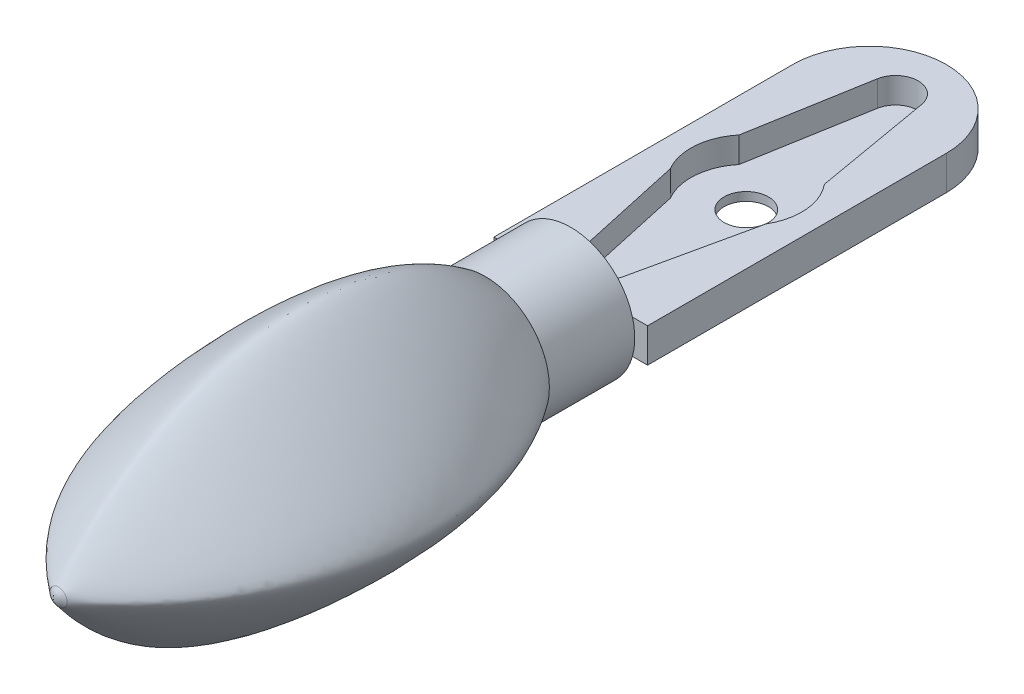
ISO-10303-21;
HEADER;
FILE_DESCRIPTION(('STEP AP214'),'2;1');
FILE_NAME('part.step','',(''),(''),'','','');
FILE_SCHEMA(('AUTOMOTIVE_DESIGN { 1 0 10303 214 1 1 1 1 }'));
ENDSEC;
DATA;
#1=APPLICATION_CONTEXT('core data for automotive mechanical design processes');
#2=APPLICATION_PROTOCOL_DEFINITION('international standard','automotive_design',2000,#1);
#3=PRODUCT_CONTEXT('',#1,'mechanical');
#4=PRODUCT('Part','Part','',(#3));
#5=PRODUCT_RELATED_PRODUCT_CATEGORY('part','',(#4));
#6=PRODUCT_DEFINITION_FORMATION('','',#4);
#7=PRODUCT_DEFINITION_CONTEXT('part definition',#1,'design');
#8=PRODUCT_DEFINITION('design','',#6,#7);
#9=PRODUCT_DEFINITION_SHAPE('','',#8);
#10=(LENGTH_UNIT() NAMED_UNIT(*) SI_UNIT(.MILLI.,.METRE.));
#11=(NAMED_UNIT(*) PLANE_ANGLE_UNIT() SI_UNIT($,.RADIAN.));
#12=(NAMED_UNIT(*) SI_UNIT($,.STERADIAN.) SOLID_ANGLE_UNIT());
#13=UNCERTAINTY_MEASURE_WITH_UNIT(LENGTH_MEASURE(1.E-05),#10,'distance_accuracy_value','');
#14=(GEOMETRIC_REPRESENTATION_CONTEXT(3) GLOBAL_UNCERTAINTY_ASSIGNED_CONTEXT((#13)) GLOBAL_UNIT_ASSIGNED_CONTEXT((#10,
#11,#12)) REPRESENTATION_CONTEXT('',''));
#15=CARTESIAN_POINT('',(0.,0.,0.));
#16=DIRECTION('',(0.,0.,1.));
#17=DIRECTION('',(1.,0.,0.));
#18=AXIS2_PLACEMENT_3D('',#15,#16,#17);
#19=CARTESIAN_POINT('',(10.0199999018431,-3.02000028851811,59.6713058607412));
#20=CARTESIAN_POINT('',(10.0200000172503,-2.61200028851814,59.9359846592579));
#21=CARTESIAN_POINT('',(10.0200001326576,-2.20400028851817,60.045061782606));
#22=CARTESIAN_POINT('',(10.0200002480648,-1.79600028851819,60.045285434479));
#23=CARTESIAN_POINT('',(10.0200003634721,-1.38800028851822,59.9358519810749));
#24=CARTESIAN_POINT('',(10.0200004788793,-0.980000288518246,59.6719841276044));
#25=CARTESIAN_POINT('',(9.81599986377084,-3.02000023081447,59.7611798395393));
#26=CARTESIAN_POINT('',(9.81599997917809,-2.6120002308145,60.0530891284426));
#27=CARTESIAN_POINT('',(9.81600009458533,-2.20400023081453,60.1740586836226));
#28=CARTESIAN_POINT('',(9.81600020999258,-1.79600023081456,60.1746436779478));
#29=CARTESIAN_POINT('',(9.81600032539983,-1.38800023081459,60.0526005432592));
#30=CARTESIAN_POINT('',(9.81600044080708,-0.980000230814612,59.7615503660819));
#31=CARTESIAN_POINT('',(9.6119998256986,-3.02000017311084,59.8452729788772));
#32=CARTESIAN_POINT('',(9.61199994110584,-2.61200017311087,60.1662060321596));
#33=CARTESIAN_POINT('',(9.61200005651309,-2.2040001731109,60.2976076752485));
#34=CARTESIAN_POINT('',(9.61200017192034,-1.79600017311093,60.2987751637316));
#35=CARTESIAN_POINT('',(9.61200028732759,-1.38800017311095,60.1652899757582));
#36=CARTESIAN_POINT('',(9.61200040273484,-0.980000173110978,59.8454013997782));
#37=CARTESIAN_POINT('',(9.40799978762636,-3.0200001154072,59.9296887772695));
#38=CARTESIAN_POINT('',(9.40799990303361,-2.61200011540723,60.2950514761496));
#39=CARTESIAN_POINT('',(9.40800001844085,-2.20400011540726,60.4217271542177));
#40=CARTESIAN_POINT('',(9.4080001338481,-1.79600011540729,60.4215732040455));
#41=CARTESIAN_POINT('',(9.40800024925534,-1.38800011540732,60.2943340917807));
#42=CARTESIAN_POINT('',(9.4080003646626,-0.980000115407343,59.9303294263708));
#43=CARTESIAN_POINT('',(9.16319973224945,-3.02000004616284,59.9906751110089));
#44=CARTESIAN_POINT('',(9.16319984765669,-2.61200004616287,60.4066717478284));
#45=CARTESIAN_POINT('',(9.16319996306394,-2.2040000461629,60.4769060065083));
#46=CARTESIAN_POINT('',(9.16320007847118,-1.79600004616293,60.4823320662432));
#47=CARTESIAN_POINT('',(9.16320019387844,-1.38800004616296,60.4039379670143));
#48=CARTESIAN_POINT('',(9.16320030928569,-0.98000004616298,59.9913886654708));
#49=CARTESIAN_POINT('',(8.91839967687254,-3.01999997691847,59.9786981725399));
#50=CARTESIAN_POINT('',(8.91839979227978,-2.61199997691851,60.3861826542139));
#51=CARTESIAN_POINT('',(8.91839990768704,-2.20399997691853,60.4648540857779));
#52=CARTESIAN_POINT('',(8.91840002309428,-1.79599997691856,60.469162877881));
#53=CARTESIAN_POINT('',(8.91840013850153,-1.38799997691859,60.3839262392396));
#54=CARTESIAN_POINT('',(8.91840025390878,-0.979999976918615,59.9793096431932));
#55=CARTESIAN_POINT('',(8.87759965956787,-3.01999996537775,59.9747084966445));
#56=CARTESIAN_POINT('',(8.87759977497512,-2.61199996537778,60.3791442810936));
#57=CARTESIAN_POINT('',(8.87759989038237,-2.2039999653778,60.4608992058125));
#58=CARTESIAN_POINT('',(8.87760000578961,-1.79599996537783,60.4649246894336));
#59=CARTESIAN_POINT('',(8.87760012119686,-1.38799996537786,60.376982972844));
#60=CARTESIAN_POINT('',(8.87760023660411,-0.979999965377885,59.9753186031182));
#61=CARTESIAN_POINT('',(8.67359962155773,-3.01999990767411,59.9460763977806));
#62=CARTESIAN_POINT('',(8.67359973696498,-2.61199990767414,60.3289409771327));
#63=CARTESIAN_POINT('',(8.67359985237222,-2.20399990767417,60.4302764471199));
#64=CARTESIAN_POINT('',(8.67359996777947,-1.7959999076742,60.4326465825806));
#65=CARTESIAN_POINT('',(8.67360008318672,-1.38799990767423,60.3273728719974));
#66=CARTESIAN_POINT('',(8.67360019859397,-0.97999990767425,59.946609425415));
#67=CARTESIAN_POINT('',(8.46959958354759,-3.01999984997047,59.8788246496406));
#68=CARTESIAN_POINT('',(8.46959969895483,-2.61199984997051,60.2166602439782));
#69=CARTESIAN_POINT('',(8.46959981436209,-2.20399984997054,60.3454706333419));
#70=CARTESIAN_POINT('',(8.46959992976933,-1.79599984997056,60.346190582432));
#71=CARTESIAN_POINT('',(8.46960004517658,-1.38799984997059,60.2158152865172));
#72=CARTESIAN_POINT('',(8.46960016058383,-0.979999849970615,59.8790348028657));
#73=CARTESIAN_POINT('',(8.30639956284212,-3.01999980380757,59.8139327161403));
#74=CARTESIAN_POINT('',(8.30639967824936,-2.6119998038076,60.1215715258685));
#75=CARTESIAN_POINT('',(8.30639979365661,-2.20399980380763,60.2474553097653));
#76=CARTESIAN_POINT('',(8.30639990906386,-1.79599980380766,60.2482160852123));
#77=CARTESIAN_POINT('',(8.30640002447111,-1.38799980380768,60.1209693720613));
#78=CARTESIAN_POINT('',(8.30640013987836,-0.979999803807709,59.814286482078));
#79=CARTESIAN_POINT('',(8.14319954213664,-3.01999975764466,59.7444310830504));
#80=CARTESIAN_POINT('',(8.14319965754389,-2.61199975764469,60.0289009097591));
#81=CARTESIAN_POINT('',(8.14319977295114,-2.20399975764472,60.1489646147589));
#82=CARTESIAN_POINT('',(8.14319988835838,-1.79599975764475,60.1492234588359));
#83=CARTESIAN_POINT('',(8.14320000376564,-1.38799975764478,60.0285716534876));
#84=CARTESIAN_POINT('',(8.14320011917289,-0.979999757644803,59.7450099194435));
#85=CARTESIAN_POINT('',(7.97999952143117,-3.01999971148176,59.6710188183758));
#86=CARTESIAN_POINT('',(7.97999963683842,-2.61199971148179,59.9342651427469));
#87=CARTESIAN_POINT('',(7.97999975224567,-2.20399971148182,60.0461448055459));
#88=CARTESIAN_POINT('',(7.97999986765291,-1.79599971148184,60.0460081890795));
#89=CARTESIAN_POINT('',(7.97999998306017,-1.38799971148187,59.9341338749382));
#90=CARTESIAN_POINT('',(7.98000009846741,-0.979999711481898,59.6718461034298));
#91=B_SPLINE_SURFACE_WITH_KNOTS('',5,5,((#19,#20,#21,#22,#23,#24),(#25,#26,#27,#28,#29,#30),
(#31,#32,#33,#34,#35,#36),(#37,#38,#39,#40,#41,#42),(#43,#44,#45,#46,#47,#48),(#49,#50,#51,#52,
#53,#54),(#55,#56,#57,#58,#59,#60),(#61,#62,#63,#64,#65,#66),(#67,#68,#69,#70,#71,#72),(#73,#74,
#75,#76,#77,#78),(#79,#80,#81,#82,#83,#84),(#85,#86,#87,#88,#89,#90)),.UNSPECIFIED.,.F.,.F.,.F.,
(6,3,3,6),(6,6),(-1.02000024710375,-5.67425053610293E-08,0.204000029780841,1.02000013330824),
(-1.02000000041239,1.01999999958755),.UNSPECIFIED.);
#92=CARTESIAN_POINT('',(9.,-3.00000000000001,60.));
#93=CARTESIAN_POINT('',(8.86910030695214,-3.00000000000001,60.));
#94=CARTESIAN_POINT('',(8.60734891089191,-2.947991074474,60.));
#95=CARTESIAN_POINT('',(8.27446701565593,-2.72553298434406,59.9999999999999));
#96=CARTESIAN_POINT('',(8.05200892552601,-2.39265108910809,60.0000000000001));
#97=CARTESIAN_POINT('',(7.99999999999999,-2.13089969304786,60.));
#98=CARTESIAN_POINT('',(7.99999999999999,-1.86910030695214,60.));
#99=CARTESIAN_POINT('',(8.05200892552601,-1.60734891089191,60.0000000000001));
#100=CARTESIAN_POINT('',(8.27446701565593,-1.27446701565593,59.9999999999998));
#101=CARTESIAN_POINT('',(8.60734891089192,-1.052008925526,60.0000000000001));
#102=CARTESIAN_POINT('',(8.86910030695214,-0.999999999999993,60.));
#103=CARTESIAN_POINT('',(9.13089969304786,-0.999999999999993,60.));
#104=CARTESIAN_POINT('',(9.39265108910809,-1.052008925526,60.));
#105=CARTESIAN_POINT('',(9.72553298434406,-1.27446701565593,60.));
#106=CARTESIAN_POINT('',(9.947991074474,-1.60734891089191,60.0000000000001));
#107=CARTESIAN_POINT('',(10.,-1.86910030695214,60.));
#108=CARTESIAN_POINT('',(10.,-2.13089969304786,60.));
#109=CARTESIAN_POINT('',(9.94799107447399,-2.39265108910809,60.));
#110=CARTESIAN_POINT('',(9.72553298434407,-2.72553298434407,60.));
#111=CARTESIAN_POINT('',(9.39265108910808,-2.947991074474,60.));
#112=CARTESIAN_POINT('',(9.13089969304786,-3.00000000000001,60.));
#113=CARTESIAN_POINT('',(9.,-3.00000000000001,60.));
#114=B_SPLINE_CURVE_WITH_KNOTS('',3,(#92,#93,#94,#95,#96,#97,#98,#99,#100,#101,#102,#103,#104,
#105,#106,#107,#108,#109,#110,#111,#112,#113),.UNSPECIFIED.,.T.,.F.,(4,1,1,1,2,1,1,1,2,1,1,1,2,
1,1,1,4),(0.,0.0625,0.125,0.1875,0.25,0.3125,0.375,0.4375,0.5,0.5625,0.625,0.6875,0.75,0.8125,
0.875,0.9375,1.),.UNSPECIFIED.);
#115=CARTESIAN_POINT('',(9.,-3.00000000000001,60.));
#116=VERTEX_POINT('',#115);
#117=EDGE_CURVE('E138',#116,#116,#114,.T.);
#118=ORIENTED_EDGE('',*,*,#117,.F.);
#119=EDGE_LOOP('',(#118));
#120=FACE_BOUND('',#119,.T.);
#121=ADVANCED_FACE('F125',(#120),#91,.F.);
#122=CARTESIAN_POINT('',(9.,5.5,10.));
#123=DIRECTION('',(0.,0.,-1.));
#124=DIRECTION('',(0.,1.,0.));
#125=AXIS2_PLACEMENT_3D('',#122,#123,#124);
#126=PLANE('',#125);
#127=CARTESIAN_POINT('',(9.,-9.5,10.));
#128=CARTESIAN_POINT('',(9.98174769785895,-9.5,10.));
#129=CARTESIAN_POINT('',(11.9449156493394,-9.10992505068653,10.));
#130=CARTESIAN_POINT('',(14.4414893574974,-7.44148935749734,9.99999999999998));
#131=CARTESIAN_POINT('',(16.1099250506865,-4.94491564933942,10.));
#132=CARTESIAN_POINT('',(16.5,-2.98174769785896,10.));
#133=CARTESIAN_POINT('',(16.5,-1.01825230214104,10.));
#134=CARTESIAN_POINT('',(16.1099250506865,0.944915649339421,10.));
#135=CARTESIAN_POINT('',(14.4414893574973,3.44148935749733,9.99999999999998));
#136=CARTESIAN_POINT('',(11.9449156493394,5.10992505068653,10.));
#137=CARTESIAN_POINT('',(9.98174769785895,5.5,10.));
#138=CARTESIAN_POINT('',(8.01825230214104,5.5,10.));
#139=CARTESIAN_POINT('',(6.05508435066059,5.10992505068652,10.));
#140=CARTESIAN_POINT('',(3.55851064250266,3.44148935749734,9.99999999999998));
#141=CARTESIAN_POINT('',(1.89007494931348,0.94491564933942,10.));
#142=CARTESIAN_POINT('',(1.5,-1.01825230214104,10.));
#143=CARTESIAN_POINT('',(1.5,-2.98174769785896,10.));
#144=CARTESIAN_POINT('',(1.89007494931348,-4.94491564933941,10.));
#145=CARTESIAN_POINT('',(3.55851064250266,-7.44148935749735,9.99999999999999));
#146=CARTESIAN_POINT('',(6.05508435066059,-9.10992505068652,10.));
#147=CARTESIAN_POINT('',(8.01825230214104,-9.5,10.));
#148=CARTESIAN_POINT('',(9.,-9.5,10.));
#149=B_SPLINE_CURVE_WITH_KNOTS('',3,(#127,#128,#129,#130,#131,#132,#133,#134,#135,#136,#137,
#138,#139,#140,#141,#142,#143,#144,#145,#146,#147,#148),.UNSPECIFIED.,.T.,.F.,(4,1,1,1,2,1,1,1,
2,1,1,1,2,1,1,1,4),(0.,0.0625,0.125,0.1875,0.25,0.3125,0.375,0.4375,0.5,0.5625,0.625,0.6875,
0.75,0.8125,0.875,0.9375,1.),.UNSPECIFIED.);
#150=CARTESIAN_POINT('',(9.,-9.5,10.));
#151=VERTEX_POINT('',#150);
#152=EDGE_CURVE('E13',#151,#151,#149,.T.);
#153=ORIENTED_EDGE('',*,*,#152,.F.);
#154=EDGE_LOOP('',(#153));
#155=FACE_BOUND('',#154,.T.);
#156=ADVANCED_FACE('F167',(#155),#126,.T.);
#157=CARTESIAN_POINT('',(9.,-9.5,10.));
#158=CARTESIAN_POINT('',(9.,-13.3872736073307,14.9789819894649));
#159=CARTESIAN_POINT('',(9.,-17.0648639396607,23.7681084370191));
#160=CARTESIAN_POINT('',(9.,-17.1229033941333,36.4134774412373));
#161=CARTESIAN_POINT('',(9.,-13.8336374596375,48.6236967448897));
#162=CARTESIAN_POINT('',(9.,-8.03108860323303,56.1804050979084));
#163=CARTESIAN_POINT('',(9.,-3.00000000000001,60.));
#164=CARTESIAN_POINT('',(9.98174769785895,-9.5,10.));
#165=CARTESIAN_POINT('',(9.88720903065772,-13.3872736073307,14.9789819894649));
#166=CARTESIAN_POINT('',(9.74540102985588,-17.0648639396607,23.7681084370191));
#167=CARTESIAN_POINT('',(9.55632369545341,-17.1229033941333,36.4134774412373));
#168=CARTESIAN_POINT('',(9.36724636105095,-13.8336374596375,48.6236967448897));
#169=CARTESIAN_POINT('',(9.22543836024909,-8.03108860323303,56.1804050979084));
#170=CARTESIAN_POINT('',(9.13089969304786,-3.00000000000001,60.));
#171=CARTESIAN_POINT('',(11.9449156493394,-9.10992505068653,10.));
#172=CARTESIAN_POINT('',(12.2375176768967,-12.458574570855,14.9789819894649));
#173=CARTESIAN_POINT('',(12.4072557083994,-15.597393782275,23.7681084370192));
#174=CARTESIAN_POINT('',(12.0278962934904,-15.5427485324469,36.4134774412373));
#175=CARTESIAN_POINT('',(11.2301237049604,-12.5592110672714,48.6236967448897));
#176=CARTESIAN_POINT('',(10.2148443378712,-7.40290848854873,56.1804050979084));
#177=CARTESIAN_POINT('',(9.39265108910808,-2.947991074474,60.));
#178=CARTESIAN_POINT('',(14.4414893574974,-7.44148935749734,9.99999999999998));
#179=CARTESIAN_POINT('',(16.2222421197012,-9.2222421197012,14.9789819894649));
#180=CARTESIAN_POINT('',(17.816711223674,-10.816711223674,23.7681084370191));
#181=CARTESIAN_POINT('',(17.5199628679874,-10.5199628679874,36.4134774412373));
#182=CARTESIAN_POINT('',(15.5495618178165,-8.54956181781652,48.6236967448896));
#183=CARTESIAN_POINT('',(12.4039613274221,-5.40396132742205,56.1804050979083));
#184=CARTESIAN_POINT('',(9.72553298434407,-2.72553298434407,60.));
#185=CARTESIAN_POINT('',(16.1099250506865,-4.94491564933942,10.));
#186=CARTESIAN_POINT('',(19.458574570855,-5.23751767689672,14.9789819894649));
#187=CARTESIAN_POINT('',(22.597393782275,-5.40725570839941,23.7681084370192));
#188=CARTESIAN_POINT('',(22.5427485324469,-5.02789629349042,36.4134774412373));
#189=CARTESIAN_POINT('',(19.5592110672714,-4.23012370496037,48.6236967448897));
#190=CARTESIAN_POINT('',(14.4029084885487,-3.21484433787125,56.1804050979084));
#191=CARTESIAN_POINT('',(9.94799107447399,-2.39265108910809,60.));
#192=CARTESIAN_POINT('',(16.5,-2.98174769785896,10.));
#193=CARTESIAN_POINT('',(20.3872736073306,-2.88720903065772,14.9789819894649));
#194=CARTESIAN_POINT('',(24.0648639396607,-2.74540102985587,23.7681084370191));
#195=CARTESIAN_POINT('',(24.1229033941333,-2.55632369545341,36.4134774412373));
#196=CARTESIAN_POINT('',(20.8336374596375,-2.36724636105094,48.6236967448897));
#197=CARTESIAN_POINT('',(15.031088603233,-2.22543836024909,56.1804050979084));
#198=CARTESIAN_POINT('',(10.,-2.13089969304786,60.));
#199=CARTESIAN_POINT('',(16.5,-1.01825230214104,10.));
#200=CARTESIAN_POINT('',(20.3872736073306,-1.11279096934228,14.9789819894649));
#201=CARTESIAN_POINT('',(24.0648639396607,-1.25459897014413,23.7681084370191));
#202=CARTESIAN_POINT('',(24.1229033941333,-1.44367630454659,36.4134774412373));
#203=CARTESIAN_POINT('',(20.8336374596375,-1.63275363894906,48.6236967448897));
#204=CARTESIAN_POINT('',(15.031088603233,-1.77456163975091,56.1804050979084));
#205=CARTESIAN_POINT('',(10.,-1.86910030695214,60.));
#206=CARTESIAN_POINT('',(16.1099250506865,0.944915649339421,10.));
#207=CARTESIAN_POINT('',(19.458574570855,1.23751767689672,14.9789819894649));
#208=CARTESIAN_POINT('',(22.597393782275,1.40725570839942,23.7681084370192));
#209=CARTESIAN_POINT('',(22.5427485324469,1.02789629349042,36.4134774412374));
#210=CARTESIAN_POINT('',(19.5592110672714,0.230123704960372,48.6236967448897));
#211=CARTESIAN_POINT('',(14.4029084885487,-0.785155662128749,56.1804050979084));
#212=CARTESIAN_POINT('',(9.947991074474,-1.60734891089191,60.0000000000001));
#213=CARTESIAN_POINT('',(14.4414893574973,3.44148935749733,9.99999999999998));
#214=CARTESIAN_POINT('',(16.2222421197012,5.2222421197012,14.9789819894649));
#215=CARTESIAN_POINT('',(17.816711223674,6.81671122367401,23.7681084370191));
#216=CARTESIAN_POINT('',(17.5199628679873,6.51996286798737,36.4134774412373));
#217=CARTESIAN_POINT('',(15.5495618178165,4.54956181781652,48.6236967448896));
#218=CARTESIAN_POINT('',(12.403961327422,1.40396132742205,56.1804050979083));
#219=CARTESIAN_POINT('',(9.72553298434406,-1.27446701565593,60.));
#220=CARTESIAN_POINT('',(11.9449156493394,5.10992505068653,10.));
#221=CARTESIAN_POINT('',(12.2375176768967,8.45857457085503,14.9789819894649));
#222=CARTESIAN_POINT('',(12.4072557083994,11.5973937822751,23.7681084370192));
#223=CARTESIAN_POINT('',(12.0278962934904,11.5427485324469,36.4134774412373));
#224=CARTESIAN_POINT('',(11.2301237049604,8.55921106727144,48.6236967448897));
#225=CARTESIAN_POINT('',(10.2148443378713,3.40290848854873,56.1804050979084));
#226=CARTESIAN_POINT('',(9.39265108910809,-1.052008925526,60.));
#227=CARTESIAN_POINT('',(9.98174769785895,5.5,10.));
#228=CARTESIAN_POINT('',(9.88720903065772,9.38727360733067,14.9789819894649));
#229=CARTESIAN_POINT('',(9.74540102985588,13.0648639396607,23.7681084370192));
#230=CARTESIAN_POINT('',(9.55632369545341,13.1229033941334,36.4134774412373));
#231=CARTESIAN_POINT('',(9.36724636105095,9.83363745963754,48.6236967448897));
#232=CARTESIAN_POINT('',(9.22543836024909,4.03108860323302,56.1804050979084));
#233=CARTESIAN_POINT('',(9.13089969304786,-0.999999999999993,60.));
#234=CARTESIAN_POINT('',(8.01825230214104,5.5,10.));
#235=CARTESIAN_POINT('',(8.11279096934227,9.38727360733067,14.9789819894649));
#236=CARTESIAN_POINT('',(8.25459897014413,13.0648639396607,23.7681084370192));
#237=CARTESIAN_POINT('',(8.44367630454659,13.1229033941334,36.4134774412373));
#238=CARTESIAN_POINT('',(8.63275363894906,9.83363745963754,48.6236967448897));
#239=CARTESIAN_POINT('',(8.7745616397509,4.03108860323302,56.1804050979084));
#240=CARTESIAN_POINT('',(8.86910030695214,-0.999999999999993,60.));
#241=CARTESIAN_POINT('',(6.05508435066059,5.10992505068652,10.));
#242=CARTESIAN_POINT('',(5.76248232310329,8.45857457085503,14.978981989465));
#243=CARTESIAN_POINT('',(5.5927442916006,11.5973937822751,23.7681084370192));
#244=CARTESIAN_POINT('',(5.97210370650959,11.5427485324469,36.4134774412374));
#245=CARTESIAN_POINT('',(6.76987629503964,8.55921106727143,48.6236967448898));
#246=CARTESIAN_POINT('',(7.78515566212876,3.40290848854873,56.1804050979085));
#247=CARTESIAN_POINT('',(8.60734891089192,-1.052008925526,60.0000000000001));
#248=CARTESIAN_POINT('',(3.55851064250266,3.44148935749734,9.99999999999998));
#249=CARTESIAN_POINT('',(1.7777578802988,5.2222421197012,14.9789819894649));
#250=CARTESIAN_POINT('',(0.183288776326013,6.81671122367401,23.7681084370191));
#251=CARTESIAN_POINT('',(0.480037132012637,6.51996286798738,36.4134774412372));
#252=CARTESIAN_POINT('',(2.45043818218349,4.54956181781652,48.6236967448895));
#253=CARTESIAN_POINT('',(5.59603867257794,1.40396132742205,56.1804050979082));
#254=CARTESIAN_POINT('',(8.27446701565593,-1.27446701565593,59.9999999999998));
#255=CARTESIAN_POINT('',(1.89007494931348,0.94491564933942,10.));
#256=CARTESIAN_POINT('',(-1.45857457085501,1.23751767689672,14.9789819894649));
#257=CARTESIAN_POINT('',(-4.59739378227501,1.40725570839942,23.7681084370192));
#258=CARTESIAN_POINT('',(-4.5427485324469,1.02789629349042,36.4134774412374));
#259=CARTESIAN_POINT('',(-1.5592110672714,0.23012370496037,48.6236967448897));
#260=CARTESIAN_POINT('',(3.59709151145128,-0.785155662128749,56.1804050979084));
#261=CARTESIAN_POINT('',(8.05200892552601,-1.60734891089191,60.0000000000001));
#262=CARTESIAN_POINT('',(1.5,-1.01825230214104,10.));
#263=CARTESIAN_POINT('',(-2.38727360733066,-1.11279096934228,14.9789819894649));
#264=CARTESIAN_POINT('',(-6.06486393966067,-1.25459897014413,23.7681084370191));
#265=CARTESIAN_POINT('',(-6.12290339413331,-1.44367630454659,36.4134774412373));
#266=CARTESIAN_POINT('',(-2.83363745963751,-1.63275363894906,48.6236967448897));
#267=CARTESIAN_POINT('',(2.96891139676698,-1.77456163975091,56.1804050979083));
#268=CARTESIAN_POINT('',(7.99999999999999,-1.86910030695214,60.));
#269=CARTESIAN_POINT('',(1.5,-2.98174769785896,10.));
#270=CARTESIAN_POINT('',(-2.38727360733066,-2.88720903065772,14.9789819894649));
#271=CARTESIAN_POINT('',(-6.06486393966067,-2.74540102985587,23.7681084370191));
#272=CARTESIAN_POINT('',(-6.12290339413331,-2.55632369545341,36.4134774412373));
#273=CARTESIAN_POINT('',(-2.83363745963751,-2.36724636105094,48.6236967448897));
#274=CARTESIAN_POINT('',(2.96891139676698,-2.22543836024909,56.1804050979083));
#275=CARTESIAN_POINT('',(7.99999999999999,-2.13089969304786,60.));
#276=CARTESIAN_POINT('',(1.89007494931348,-4.94491564933941,10.));
#277=CARTESIAN_POINT('',(-1.45857457085501,-5.23751767689671,14.9789819894649));
#278=CARTESIAN_POINT('',(-4.59739378227501,-5.40725570839941,23.7681084370192));
#279=CARTESIAN_POINT('',(-4.5427485324469,-5.02789629349042,36.4134774412374));
#280=CARTESIAN_POINT('',(-1.5592110672714,-4.23012370496037,48.6236967448897));
#281=CARTESIAN_POINT('',(3.59709151145129,-3.21484433787126,56.1804050979084));
#282=CARTESIAN_POINT('',(8.05200892552601,-2.39265108910809,60.0000000000001));
#283=CARTESIAN_POINT('',(3.55851064250266,-7.44148935749735,9.99999999999999));
#284=CARTESIAN_POINT('',(1.7777578802988,-9.2222421197012,14.9789819894649));
#285=CARTESIAN_POINT('',(0.183288776326013,-10.816711223674,23.7681084370191));
#286=CARTESIAN_POINT('',(0.480037132012639,-10.5199628679874,36.4134774412373));
#287=CARTESIAN_POINT('',(2.45043818218349,-8.54956181781652,48.6236967448896));
#288=CARTESIAN_POINT('',(5.59603867257795,-5.40396132742205,56.1804050979083));
#289=CARTESIAN_POINT('',(8.27446701565593,-2.72553298434406,59.9999999999999));
#290=CARTESIAN_POINT('',(6.05508435066059,-9.10992505068652,10.));
#291=CARTESIAN_POINT('',(5.76248232310329,-12.458574570855,14.9789819894649));
#292=CARTESIAN_POINT('',(5.5927442916006,-15.597393782275,23.7681084370192));
#293=CARTESIAN_POINT('',(5.97210370650959,-15.5427485324469,36.4134774412373));
#294=CARTESIAN_POINT('',(6.76987629503964,-12.5592110672714,48.6236967448897));
#295=CARTESIAN_POINT('',(7.78515566212875,-7.40290848854873,56.1804050979084));
#296=CARTESIAN_POINT('',(8.60734891089191,-2.947991074474,60.));
#297=CARTESIAN_POINT('',(8.01825230214104,-9.5,10.));
#298=CARTESIAN_POINT('',(8.11279096934227,-13.3872736073307,14.9789819894649));
#299=CARTESIAN_POINT('',(8.25459897014413,-17.0648639396607,23.7681084370191));
#300=CARTESIAN_POINT('',(8.44367630454659,-17.1229033941333,36.4134774412373));
#301=CARTESIAN_POINT('',(8.63275363894906,-13.8336374596375,48.6236967448897));
#302=CARTESIAN_POINT('',(8.7745616397509,-8.03108860323303,56.1804050979084));
#303=CARTESIAN_POINT('',(8.86910030695214,-3.00000000000001,60.));
#304=CARTESIAN_POINT('',(9.,-9.5,10.));
#305=CARTESIAN_POINT('',(9.,-13.3872736073307,14.9789819894649));
#306=CARTESIAN_POINT('',(9.,-17.0648639396607,23.7681084370191));
#307=CARTESIAN_POINT('',(9.,-17.1229033941333,36.4134774412373));
#308=CARTESIAN_POINT('',(9.,-13.8336374596375,48.6236967448897));
#309=CARTESIAN_POINT('',(9.,-8.03108860323303,56.1804050979084));
#310=CARTESIAN_POINT('',(9.,-3.00000000000001,60.));
#311=B_SPLINE_SURFACE_WITH_KNOTS('',3,3,((#157,#158,#159,#160,#161,#162,#163),(#164,#165,#166,
#167,#168,#169,#170),(#171,#172,#173,#174,#175,#176,#177),(#178,#179,#180,#181,#182,#183,#184),
(#185,#186,#187,#188,#189,#190,#191),(#192,#193,#194,#195,#196,#197,#198),(#199,#200,#201,#202,
#203,#204,#205),(#206,#207,#208,#209,#210,#211,#212),(#213,#214,#215,#216,#217,#218,#219),(#220,
#221,#222,#223,#224,#225,#226),(#227,#228,#229,#230,#231,#232,#233),(#234,#235,#236,#237,#238,
#239,#240),(#241,#242,#243,#244,#245,#246,#247),(#248,#249,#250,#251,#252,#253,#254),(#255,#256,
#257,#258,#259,#260,#261),(#262,#263,#264,#265,#266,#267,#268),(#269,#270,#271,#272,#273,#274,
#275),(#276,#277,#278,#279,#280,#281,#282),(#283,#284,#285,#286,#287,#288,#289),(#290,#291,#292,
#293,#294,#295,#296),(#297,#298,#299,#300,#301,#302,#303),(#304,#305,#306,#307,#308,#309,#310)),
.UNSPECIFIED.,.T.,.F.,.F.,(4,1,1,1,2,1,1,1,2,1,1,1,2,1,1,1,4),(4,1,1,1,4),(0.,0.0625,0.125,
0.1875,0.25,0.3125,0.375,0.4375,0.5,0.5625,0.625,0.6875,0.75,0.8125,0.875,0.9375,1.),(0.,
0.333333333333333,0.5,0.666666666666667,1.),.UNSPECIFIED.);
#312=ORIENTED_EDGE('',*,*,#152,.T.);
#313=EDGE_LOOP('',(#312));
#314=FACE_BOUND('',#313,.T.);
#315=ORIENTED_EDGE('',*,*,#117,.T.);
#316=EDGE_LOOP('',(#315));
#317=FACE_BOUND('',#316,.T.);
#318=ADVANCED_FACE('F165',(#314,#317),#311,.T.);
#319=CLOSED_SHELL('',(#121,#156,#318));
#320=MANIFOLD_SOLID_BREP('B2',#319);
#321=CARTESIAN_POINT('',(18.,-4.,0.));
#322=DIRECTION('',(0.,0.,-1.));
#323=DIRECTION('',(-1.,0.,0.));
#324=AXIS2_PLACEMENT_3D('',#321,#322,#323);
#325=PLANE('',#324);
#326=CARTESIAN_POINT('',(9.,-2.,0.));
#327=DIRECTION('',(0.,0.,1.));
#328=DIRECTION('',(1.,0.,0.));
#329=AXIS2_PLACEMENT_3D('',#326,#327,#328);
#330=CIRCLE('',#329,7.5);
#331=CARTESIAN_POINT('',(1.77158385259952,0.,0.));
#332=VERTEX_POINT('',#331);
#333=CARTESIAN_POINT('',(1.77158385259952,-4.,0.));
#334=VERTEX_POINT('',#333);
#335=EDGE_CURVE('E123',#332,#334,#330,.T.);
#336=ORIENTED_EDGE('',*,*,#335,.F.);
#337=DIRECTION('',(-1.,0.,0.));
#338=VECTOR('',#337,1.);
#339=CARTESIAN_POINT('',(18.,0.,0.));
#340=LINE('',#339,#338);
#341=CARTESIAN_POINT('',(0.,0.,0.));
#342=VERTEX_POINT('',#341);
#343=EDGE_CURVE('E327',#332,#342,#340,.T.);
#344=ORIENTED_EDGE('',*,*,#343,.T.);
#345=DIRECTION('',(0.,1.,0.));
#346=VECTOR('',#345,1.);
#347=CARTESIAN_POINT('',(0.,-4.,0.));
#348=LINE('',#347,#346);
#349=CARTESIAN_POINT('',(0.,-4.,0.));
#350=VERTEX_POINT('',#349);
#351=EDGE_CURVE('E340',#350,#342,#348,.T.);
#352=ORIENTED_EDGE('',*,*,#351,.F.);
#353=DIRECTION('',(-1.,0.,0.));
#354=VECTOR('',#353,1.);
#355=CARTESIAN_POINT('',(18.,-4.,0.));
#356=LINE('',#355,#354);
#357=EDGE_CURVE('E233',#334,#350,#356,.T.);
#358=ORIENTED_EDGE('',*,*,#357,.F.);
#359=EDGE_LOOP('',(#336,#344,#352,#358));
#360=FACE_BOUND('',#359,.T.);
#361=ADVANCED_FACE('F215',(#360),#325,.F.);
#362=CARTESIAN_POINT('',(16.2284161474005,-4.,0.));
#363=VERTEX_POINT('',#362);
#364=CARTESIAN_POINT('',(16.2284161474005,0.,0.));
#365=VERTEX_POINT('',#364);
#366=EDGE_CURVE('E224',#363,#365,#330,.T.);
#367=ORIENTED_EDGE('',*,*,#366,.F.);
#368=CARTESIAN_POINT('',(18.,-4.,0.));
#369=VERTEX_POINT('',#368);
#370=EDGE_CURVE('E411',#369,#363,#356,.T.);
#371=ORIENTED_EDGE('',*,*,#370,.F.);
#372=DIRECTION('',(0.,1.,0.));
#373=VECTOR('',#372,1.);
#374=CARTESIAN_POINT('',(18.,-4.,0.));
#375=LINE('',#374,#373);
#376=CARTESIAN_POINT('',(18.,0.,0.));
#377=VERTEX_POINT('',#376);
#378=EDGE_CURVE('E321',#369,#377,#375,.T.);
#379=ORIENTED_EDGE('',*,*,#378,.T.);
#380=EDGE_CURVE('E318',#377,#365,#340,.T.);
#381=ORIENTED_EDGE('',*,*,#380,.T.);
#382=EDGE_LOOP('',(#367,#371,#379,#381));
#383=FACE_BOUND('',#382,.T.);
#384=ADVANCED_FACE('F217',(#383),#325,.F.);
#385=CARTESIAN_POINT('',(0.,-4.,0.));
#386=DIRECTION('',(1.,0.,0.));
#387=DIRECTION('',(0.,0.,-1.));
#388=AXIS2_PLACEMENT_3D('',#385,#386,#387);
#389=PLANE('',#388);
#390=DIRECTION('',(0.,0.,-1.));
#391=VECTOR('',#390,1.);
#392=CARTESIAN_POINT('',(0.,0.,0.));
#393=LINE('',#392,#391);
#394=CARTESIAN_POINT('',(0.,0.,-35.));
#395=VERTEX_POINT('',#394);
#396=EDGE_CURVE('E324',#342,#395,#393,.T.);
#397=ORIENTED_EDGE('',*,*,#396,.T.);
#398=DIRECTION('',(0.,1.,0.));
#399=VECTOR('',#398,1.);
#400=CARTESIAN_POINT('',(0.,-4.,-35.));
#401=LINE('',#400,#399);
#402=CARTESIAN_POINT('',(0.,-4.,-35.));
#403=VERTEX_POINT('',#402);
#404=EDGE_CURVE('E429',#403,#395,#401,.T.);
#405=ORIENTED_EDGE('',*,*,#404,.F.);
#406=DIRECTION('',(0.,0.,-1.));
#407=VECTOR('',#406,1.);
#408=CARTESIAN_POINT('',(0.,-4.,0.));
#409=LINE('',#408,#407);
#410=EDGE_CURVE('E413',#350,#403,#409,.T.);
#411=ORIENTED_EDGE('',*,*,#410,.F.);
#412=ORIENTED_EDGE('',*,*,#351,.T.);
#413=EDGE_LOOP('',(#397,#405,#411,#412));
#414=FACE_BOUND('',#413,.T.);
#415=ADVANCED_FACE('F434',(#414),#389,.F.);
#416=CARTESIAN_POINT('',(9.,-4.,-35.));
#417=DIRECTION('',(0.,1.,0.));
#418=DIRECTION('',(0.,0.,1.));
#419=AXIS2_PLACEMENT_3D('',#416,#417,#418);
#420=CYLINDRICAL_SURFACE('',#419,9.);
#421=CARTESIAN_POINT('',(9.,0.,-35.));
#422=DIRECTION('',(0.,-1.,0.));
#423=DIRECTION('',(0.,0.,-1.));
#424=AXIS2_PLACEMENT_3D('',#421,#422,#423);
#425=CIRCLE('',#424,9.);
#426=CARTESIAN_POINT('',(18.,0.,-35.));
#427=VERTEX_POINT('',#426);
#428=EDGE_CURVE('E421',#395,#427,#425,.T.);
#429=ORIENTED_EDGE('',*,*,#428,.T.);
#430=DIRECTION('',(0.,1.,0.));
#431=VECTOR('',#430,1.);
#432=CARTESIAN_POINT('',(18.,-4.,-35.));
#433=LINE('',#432,#431);
#434=CARTESIAN_POINT('',(18.,-4.,-35.));
#435=VERTEX_POINT('',#434);
#436=EDGE_CURVE('E426',#435,#427,#433,.T.);
#437=ORIENTED_EDGE('',*,*,#436,.F.);
#438=CARTESIAN_POINT('',(9.,-4.,-35.));
#439=DIRECTION('',(0.,-1.,0.));
#440=DIRECTION('',(0.,0.,-1.));
#441=AXIS2_PLACEMENT_3D('',#438,#439,#440);
#442=CIRCLE('',#441,9.);
#443=EDGE_CURVE('E416',#403,#435,#442,.T.);
#444=ORIENTED_EDGE('',*,*,#443,.F.);
#445=ORIENTED_EDGE('',*,*,#404,.T.);
#446=EDGE_LOOP('',(#429,#437,#444,#445));
#447=FACE_BOUND('',#446,.T.);
#448=ADVANCED_FACE('F439',(#447),#420,.T.);
#449=CARTESIAN_POINT('',(18.,-4.,-35.));
#450=DIRECTION('',(-1.,0.,0.));
#451=DIRECTION('',(0.,0.,1.));
#452=AXIS2_PLACEMENT_3D('',#449,#450,#451);
#453=PLANE('',#452);
#454=DIRECTION('',(0.,0.,1.));
#455=VECTOR('',#454,1.);
#456=CARTESIAN_POINT('',(18.,0.,-35.));
#457=LINE('',#456,#455);
#458=EDGE_CURVE('E423',#427,#377,#457,.T.);
#459=ORIENTED_EDGE('',*,*,#458,.T.);
#460=ORIENTED_EDGE('',*,*,#378,.F.);
#461=DIRECTION('',(0.,0.,1.));
#462=VECTOR('',#461,1.);
#463=CARTESIAN_POINT('',(18.,-4.,-35.));
#464=LINE('',#463,#462);
#465=EDGE_CURVE('E418',#435,#369,#464,.T.);
#466=ORIENTED_EDGE('',*,*,#465,.F.);
#467=ORIENTED_EDGE('',*,*,#436,.T.);
#468=EDGE_LOOP('',(#459,#460,#466,#467));
#469=FACE_BOUND('',#468,.T.);
#470=ADVANCED_FACE('F443',(#469),#453,.F.);
#471=CARTESIAN_POINT('',(9.,-4.,-35.));
#472=DIRECTION('',(0.,-1.,0.));
#473=DIRECTION('',(0.,0.,-1.));
#474=AXIS2_PLACEMENT_3D('',#471,#472,#473);
#475=PLANE('',#474);
#476=CARTESIAN_POINT('',(9.,-4.,-20.5602345410471));
#477=DIRECTION('',(0.,1.,0.));
#478=DIRECTION('',(0.,0.,1.));
#479=AXIS2_PLACEMENT_3D('',#476,#477,#478);
#480=CIRCLE('',#479,2.6);
#481=CARTESIAN_POINT('',(9.,-4.,-17.9602345410471));
#482=VERTEX_POINT('',#481);
#483=EDGE_CURVE('E344',#482,#482,#480,.T.);
#484=ORIENTED_EDGE('',*,*,#483,.T.);
#485=EDGE_LOOP('',(#484));
#486=FACE_BOUND('',#485,.T.);
#487=ORIENTED_EDGE('',*,*,#370,.T.);
#488=EDGE_CURVE('E414',#363,#334,#356,.T.);
#489=ORIENTED_EDGE('',*,*,#488,.T.);
#490=ORIENTED_EDGE('',*,*,#357,.T.);
#491=ORIENTED_EDGE('',*,*,#410,.T.);
#492=ORIENTED_EDGE('',*,*,#443,.T.);
#493=ORIENTED_EDGE('',*,*,#465,.T.);
#494=EDGE_LOOP('',(#487,#489,#490,#491,#492,#493));
#495=FACE_BOUND('',#494,.T.);
#496=ADVANCED_FACE('F445',(#486,#495),#475,.T.);
#497=CARTESIAN_POINT('',(9.,0.,-35.));
#498=DIRECTION('',(0.,-1.,0.));
#499=DIRECTION('',(0.,0.,-1.));
#500=AXIS2_PLACEMENT_3D('',#497,#498,#499);
#501=PLANE('',#500);
#502=DIRECTION('',(-0.171428571428571,0.,0.98519655140381));
#503=VECTOR('',#502,1.);
#504=CARTESIAN_POINT('',(6.4,0.,-38.5062981921595));
#505=LINE('',#504,#503);
#506=CARTESIAN_POINT('',(6.4,0.,-38.5062981921595));
#507=VERTEX_POINT('',#506);
#508=CARTESIAN_POINT('',(4.,0.,-24.7135464725062));
#509=VERTEX_POINT('',#508);
#510=EDGE_CURVE('E375',#507,#509,#505,.T.);
#511=ORIENTED_EDGE('',*,*,#510,.F.);
#512=CARTESIAN_POINT('',(9.,0.,-38.0538866555182));
#513=DIRECTION('',(0.,1.,0.));
#514=DIRECTION('',(0.,0.,1.));
#515=AXIS2_PLACEMENT_3D('',#512,#513,#514);
#516=CIRCLE('',#515,2.63906729707412);
#517=CARTESIAN_POINT('',(11.6,0.,-38.5062981921595));
#518=VERTEX_POINT('',#517);
#519=EDGE_CURVE('E373',#518,#507,#516,.T.);
#520=ORIENTED_EDGE('',*,*,#519,.F.);
#521=DIRECTION('',(0.171428571428572,0.,0.98519655140381));
#522=VECTOR('',#521,1.);
#523=CARTESIAN_POINT('',(11.6,0.,-38.5062981921595));
#524=LINE('',#523,#522);
#525=CARTESIAN_POINT('',(14.,0.,-24.7135464725062));
#526=VERTEX_POINT('',#525);
#527=EDGE_CURVE('E353',#518,#526,#524,.T.);
#528=ORIENTED_EDGE('',*,*,#527,.T.);
#529=CARTESIAN_POINT('',(9.,0.,-20.5602345410471));
#530=DIRECTION('',(0.,1.,0.));
#531=DIRECTION('',(0.,0.,1.));
#532=AXIS2_PLACEMENT_3D('',#529,#530,#531);
#533=CIRCLE('',#532,6.5);
#534=CARTESIAN_POINT('',(14.6028914192137,0.,-17.2651461136295));
#535=VERTEX_POINT('',#534);
#536=EDGE_CURVE('E390',#535,#526,#533,.T.);
#537=ORIENTED_EDGE('',*,*,#536,.F.);
#538=DIRECTION('',(-0.214492244229548,0.,0.976725691873298));
#539=VECTOR('',#538,1.);
#540=CARTESIAN_POINT('',(14.6028914192137,0.,-17.2651461136295));
#541=LINE('',#540,#539);
#542=CARTESIAN_POINT('',(11.6,0.,-3.59098642740331));
#543=VERTEX_POINT('',#542);
#544=EDGE_CURVE('E387',#535,#543,#541,.T.);
#545=ORIENTED_EDGE('',*,*,#544,.T.);
#546=CARTESIAN_POINT('',(9.,0.,-4.16195516472323));
#547=DIRECTION('',(0.,1.,0.));
#548=DIRECTION('',(0.,0.,1.));
#549=AXIS2_PLACEMENT_3D('',#546,#547,#548);
#550=CIRCLE('',#549,2.66195516472323);
#551=CARTESIAN_POINT('',(6.4,0.,-3.59098642740331));
#552=VERTEX_POINT('',#551);
#553=EDGE_CURVE('E384',#552,#543,#550,.T.);
#554=ORIENTED_EDGE('',*,*,#553,.F.);
#555=DIRECTION('',(0.214492244229548,0.,0.976725691873297));
#556=VECTOR('',#555,1.);
#557=CARTESIAN_POINT('',(3.39710858078633,0.,-17.2651461136295));
#558=LINE('',#557,#556);
#559=CARTESIAN_POINT('',(3.39710858078633,0.,-17.2651461136295));
#560=VERTEX_POINT('',#559);
#561=EDGE_CURVE('E381',#560,#552,#558,.T.);
#562=ORIENTED_EDGE('',*,*,#561,.F.);
#563=CARTESIAN_POINT('',(9.,0.,-20.5602345410471));
#564=DIRECTION('',(0.,1.,0.));
#565=DIRECTION('',(0.,0.,1.));
#566=AXIS2_PLACEMENT_3D('',#563,#564,#565);
#567=CIRCLE('',#566,6.5);
#568=EDGE_CURVE('E378',#509,#560,#567,.T.);
#569=ORIENTED_EDGE('',*,*,#568,.F.);
#570=EDGE_LOOP('',(#511,#520,#528,#537,#545,#554,#562,#569));
#571=FACE_BOUND('',#570,.T.);
#572=ORIENTED_EDGE('',*,*,#380,.F.);
#573=ORIENTED_EDGE('',*,*,#458,.F.);
#574=ORIENTED_EDGE('',*,*,#428,.F.);
#575=ORIENTED_EDGE('',*,*,#396,.F.);
#576=ORIENTED_EDGE('',*,*,#343,.F.);
#577=EDGE_CURVE('E325',#365,#332,#340,.T.);
#578=ORIENTED_EDGE('',*,*,#577,.F.);
#579=EDGE_LOOP('',(#572,#573,#574,#575,#576,#578));
#580=FACE_BOUND('',#579,.T.);
#581=ADVANCED_FACE('F330',(#571,#580),#501,.F.);
#582=CARTESIAN_POINT('',(9.,-3.,-38.0538866555182));
#583=DIRECTION('',(0.,1.,0.));
#584=DIRECTION('',(0.,0.,1.));
#585=AXIS2_PLACEMENT_3D('',#582,#583,#584);
#586=CYLINDRICAL_SURFACE('',#585,2.63906729707412);
#587=ORIENTED_EDGE('',*,*,#519,.T.);
#588=DIRECTION('',(0.,1.,0.));
#589=VECTOR('',#588,1.);
#590=CARTESIAN_POINT('',(6.4,-3.,-38.5062981921595));
#591=LINE('',#590,#589);
#592=CARTESIAN_POINT('',(6.4,-3.,-38.5062981921595));
#593=VERTEX_POINT('',#592);
#594=EDGE_CURVE('E372',#593,#507,#591,.T.);
#595=ORIENTED_EDGE('',*,*,#594,.F.);
#596=CARTESIAN_POINT('',(9.,-3.,-38.0538866555182));
#597=DIRECTION('',(0.,1.,0.));
#598=DIRECTION('',(0.,0.,1.));
#599=AXIS2_PLACEMENT_3D('',#596,#597,#598);
#600=CIRCLE('',#599,2.63906729707412);
#601=CARTESIAN_POINT('',(11.6,-3.,-38.5062981921595));
#602=VERTEX_POINT('',#601);
#603=EDGE_CURVE('E349',#602,#593,#600,.T.);
#604=ORIENTED_EDGE('',*,*,#603,.F.);
#605=DIRECTION('',(0.,1.,0.));
#606=VECTOR('',#605,1.);
#607=CARTESIAN_POINT('',(11.6,-3.,-38.5062981921595));
#608=LINE('',#607,#606);
#609=EDGE_CURVE('E395',#602,#518,#608,.T.);
#610=ORIENTED_EDGE('',*,*,#609,.T.);
#611=EDGE_LOOP('',(#587,#595,#604,#610));
#612=FACE_BOUND('',#611,.T.);
#613=ADVANCED_FACE('F476',(#612),#586,.F.);
#614=CARTESIAN_POINT('',(11.6,-3.,-38.5062981921595));
#615=DIRECTION('',(-0.985196551403809,0.,0.171428571428572));
#616=DIRECTION('',(0.171428571428572,0.,0.98519655140381));
#617=AXIS2_PLACEMENT_3D('',#614,#615,#616);
#618=PLANE('',#617);
#619=ORIENTED_EDGE('',*,*,#527,.F.);
#620=ORIENTED_EDGE('',*,*,#609,.F.);
#621=DIRECTION('',(0.171428571428572,0.,0.98519655140381));
#622=VECTOR('',#621,1.);
#623=CARTESIAN_POINT('',(11.6,-3.,-38.5062981921595));
#624=LINE('',#623,#622);
#625=CARTESIAN_POINT('',(14.,-3.,-24.7135464725062));
#626=VERTEX_POINT('',#625);
#627=EDGE_CURVE('E370',#602,#626,#624,.T.);
#628=ORIENTED_EDGE('',*,*,#627,.T.);
#629=DIRECTION('',(0.,1.,0.));
#630=VECTOR('',#629,1.);
#631=CARTESIAN_POINT('',(14.,-3.,-24.7135464725062));
#632=LINE('',#631,#630);
#633=EDGE_CURVE('E397',#626,#526,#632,.T.);
#634=ORIENTED_EDGE('',*,*,#633,.T.);
#635=EDGE_LOOP('',(#619,#620,#628,#634));
#636=FACE_BOUND('',#635,.T.);
#637=ADVANCED_FACE('F483',(#636),#618,.T.);
#638=CARTESIAN_POINT('',(9.,-3.,-20.5602345410471));
#639=DIRECTION('',(0.,1.,0.));
#640=DIRECTION('',(0.,0.,1.));
#641=AXIS2_PLACEMENT_3D('',#638,#639,#640);
#642=CYLINDRICAL_SURFACE('',#641,6.5);
#643=ORIENTED_EDGE('',*,*,#536,.T.);
#644=ORIENTED_EDGE('',*,*,#633,.F.);
#645=CARTESIAN_POINT('',(9.,-3.,-20.5602345410471));
#646=DIRECTION('',(0.,1.,0.));
#647=DIRECTION('',(0.,0.,1.));
#648=AXIS2_PLACEMENT_3D('',#645,#646,#647);
#649=CIRCLE('',#648,6.5);
#650=CARTESIAN_POINT('',(14.6028914192137,-3.,-17.2651461136295));
#651=VERTEX_POINT('',#650);
#652=EDGE_CURVE('E367',#651,#626,#649,.T.);
#653=ORIENTED_EDGE('',*,*,#652,.F.);
#654=DIRECTION('',(0.,1.,0.));
#655=VECTOR('',#654,1.);
#656=CARTESIAN_POINT('',(14.6028914192137,-3.,-17.2651461136295));
#657=LINE('',#656,#655);
#658=EDGE_CURVE('E399',#651,#535,#657,.T.);
#659=ORIENTED_EDGE('',*,*,#658,.T.);
#660=EDGE_LOOP('',(#643,#644,#653,#659));
#661=FACE_BOUND('',#660,.T.);
#662=ADVANCED_FACE('F505',(#661),#642,.F.);
#663=CARTESIAN_POINT('',(14.6028914192137,-3.,-17.2651461136295));
#664=DIRECTION('',(-0.976725691873297,0.,-0.214492244229548));
#665=DIRECTION('',(-0.214492244229548,0.,0.976725691873298));
#666=AXIS2_PLACEMENT_3D('',#663,#664,#665);
#667=PLANE('',#666);
#668=ORIENTED_EDGE('',*,*,#544,.F.);
#669=ORIENTED_EDGE('',*,*,#658,.F.);
#670=DIRECTION('',(-0.214492244229548,0.,0.976725691873298));
#671=VECTOR('',#670,1.);
#672=CARTESIAN_POINT('',(14.6028914192137,-3.,-17.2651461136295));
#673=LINE('',#672,#671);
#674=CARTESIAN_POINT('',(11.6,-3.,-3.59098642740331));
#675=VERTEX_POINT('',#674);
#676=EDGE_CURVE('E365',#651,#675,#673,.T.);
#677=ORIENTED_EDGE('',*,*,#676,.T.);
#678=DIRECTION('',(0.,1.,0.));
#679=VECTOR('',#678,1.);
#680=CARTESIAN_POINT('',(11.6,-3.,-3.59098642740331));
#681=LINE('',#680,#679);
#682=EDGE_CURVE('E401',#675,#543,#681,.T.);
#683=ORIENTED_EDGE('',*,*,#682,.T.);
#684=EDGE_LOOP('',(#668,#669,#677,#683));
#685=FACE_BOUND('',#684,.T.);
#686=ADVANCED_FACE('F501',(#685),#667,.T.);
#687=CARTESIAN_POINT('',(9.,-3.,-4.16195516472323));
#688=DIRECTION('',(0.,1.,0.));
#689=DIRECTION('',(0.,0.,1.));
#690=AXIS2_PLACEMENT_3D('',#687,#688,#689);
#691=CYLINDRICAL_SURFACE('',#690,2.66195516472323);
#692=ORIENTED_EDGE('',*,*,#553,.T.);
#693=ORIENTED_EDGE('',*,*,#682,.F.);
#694=CARTESIAN_POINT('',(9.,-3.,-4.16195516472323));
#695=DIRECTION('',(0.,1.,0.));
#696=DIRECTION('',(0.,0.,1.));
#697=AXIS2_PLACEMENT_3D('',#694,#695,#696);
#698=CIRCLE('',#697,2.66195516472323);
#699=CARTESIAN_POINT('',(6.4,-3.,-3.59098642740331));
#700=VERTEX_POINT('',#699);
#701=EDGE_CURVE('E362',#700,#675,#698,.T.);
#702=ORIENTED_EDGE('',*,*,#701,.F.);
#703=DIRECTION('',(0.,1.,0.));
#704=VECTOR('',#703,1.);
#705=CARTESIAN_POINT('',(6.4,-3.,-3.59098642740331));
#706=LINE('',#705,#704);
#707=EDGE_CURVE('E403',#700,#552,#706,.T.);
#708=ORIENTED_EDGE('',*,*,#707,.T.);
#709=EDGE_LOOP('',(#692,#693,#702,#708));
#710=FACE_BOUND('',#709,.T.);
#711=ADVANCED_FACE('F497',(#710),#691,.F.);
#712=CARTESIAN_POINT('',(3.39710858078633,-3.,-17.2651461136295));
#713=DIRECTION('',(-0.976725691873297,0.,0.214492244229548));
#714=DIRECTION('',(0.214492244229548,0.,0.976725691873297));
#715=AXIS2_PLACEMENT_3D('',#712,#713,#714);
#716=PLANE('',#715);
#717=ORIENTED_EDGE('',*,*,#561,.T.);
#718=ORIENTED_EDGE('',*,*,#707,.F.);
#719=DIRECTION('',(0.214492244229548,0.,0.976725691873297));
#720=VECTOR('',#719,1.);
#721=CARTESIAN_POINT('',(3.39710858078633,-3.,-17.2651461136295));
#722=LINE('',#721,#720);
#723=CARTESIAN_POINT('',(3.39710858078633,-3.,-17.2651461136295));
#724=VERTEX_POINT('',#723);
#725=EDGE_CURVE('E359',#724,#700,#722,.T.);
#726=ORIENTED_EDGE('',*,*,#725,.F.);
#727=DIRECTION('',(0.,1.,0.));
#728=VECTOR('',#727,1.);
#729=CARTESIAN_POINT('',(3.39710858078633,-3.,-17.2651461136295));
#730=LINE('',#729,#728);
#731=EDGE_CURVE('E405',#724,#560,#730,.T.);
#732=ORIENTED_EDGE('',*,*,#731,.T.);
#733=EDGE_LOOP('',(#717,#718,#726,#732));
#734=FACE_BOUND('',#733,.T.);
#735=ADVANCED_FACE('F493',(#734),#716,.F.);
#736=CARTESIAN_POINT('',(9.,-3.,-20.5602345410471));
#737=DIRECTION('',(0.,1.,0.));
#738=DIRECTION('',(0.,0.,1.));
#739=AXIS2_PLACEMENT_3D('',#736,#737,#738);
#740=CYLINDRICAL_SURFACE('',#739,6.5);
#741=ORIENTED_EDGE('',*,*,#568,.T.);
#742=ORIENTED_EDGE('',*,*,#731,.F.);
#743=CARTESIAN_POINT('',(9.,-3.,-20.5602345410471));
#744=DIRECTION('',(0.,1.,0.));
#745=DIRECTION('',(0.,0.,1.));
#746=AXIS2_PLACEMENT_3D('',#743,#744,#745);
#747=CIRCLE('',#746,6.5);
#748=CARTESIAN_POINT('',(4.,-3.,-24.7135464725062));
#749=VERTEX_POINT('',#748);
#750=EDGE_CURVE('E356',#749,#724,#747,.T.);
#751=ORIENTED_EDGE('',*,*,#750,.F.);
#752=DIRECTION('',(0.,1.,0.));
#753=VECTOR('',#752,1.);
#754=CARTESIAN_POINT('',(4.,-3.,-24.7135464725062));
#755=LINE('',#754,#753);
#756=EDGE_CURVE('E407',#749,#509,#755,.T.);
#757=ORIENTED_EDGE('',*,*,#756,.T.);
#758=EDGE_LOOP('',(#741,#742,#751,#757));
#759=FACE_BOUND('',#758,.T.);
#760=ADVANCED_FACE('F489',(#759),#740,.F.);
#761=CARTESIAN_POINT('',(6.4,-3.,-38.5062981921595));
#762=DIRECTION('',(-0.985196551403809,0.,-0.171428571428571));
#763=DIRECTION('',(-0.171428571428571,0.,0.98519655140381));
#764=AXIS2_PLACEMENT_3D('',#761,#762,#763);
#765=PLANE('',#764);
#766=ORIENTED_EDGE('',*,*,#510,.T.);
#767=ORIENTED_EDGE('',*,*,#756,.F.);
#768=DIRECTION('',(-0.171428571428571,0.,0.98519655140381));
#769=VECTOR('',#768,1.);
#770=CARTESIAN_POINT('',(6.4,-3.,-38.5062981921595));
#771=LINE('',#770,#769);
#772=EDGE_CURVE('E352',#593,#749,#771,.T.);
#773=ORIENTED_EDGE('',*,*,#772,.F.);
#774=ORIENTED_EDGE('',*,*,#594,.T.);
#775=EDGE_LOOP('',(#766,#767,#773,#774));
#776=FACE_BOUND('',#775,.T.);
#777=ADVANCED_FACE('F485',(#776),#765,.F.);
#778=CARTESIAN_POINT('',(9.,-3.,-38.0538866555182));
#779=DIRECTION('',(0.,1.,0.));
#780=DIRECTION('',(0.,0.,1.));
#781=AXIS2_PLACEMENT_3D('',#778,#779,#780);
#782=PLANE('',#781);
#783=CARTESIAN_POINT('',(9.,-3.,-20.5602345410471));
#784=DIRECTION('',(0.,1.,0.));
#785=DIRECTION('',(0.,0.,1.));
#786=AXIS2_PLACEMENT_3D('',#783,#784,#785);
#787=CIRCLE('',#786,2.6);
#788=CARTESIAN_POINT('',(9.,-3.,-17.9602345410471));
#789=VERTEX_POINT('',#788);
#790=EDGE_CURVE('E219',#789,#789,#787,.T.);
#791=ORIENTED_EDGE('',*,*,#790,.F.);
#792=EDGE_LOOP('',(#791));
#793=FACE_BOUND('',#792,.T.);
#794=ORIENTED_EDGE('',*,*,#603,.T.);
#795=ORIENTED_EDGE('',*,*,#772,.T.);
#796=ORIENTED_EDGE('',*,*,#750,.T.);
#797=ORIENTED_EDGE('',*,*,#725,.T.);
#798=ORIENTED_EDGE('',*,*,#701,.T.);
#799=ORIENTED_EDGE('',*,*,#676,.F.);
#800=ORIENTED_EDGE('',*,*,#652,.T.);
#801=ORIENTED_EDGE('',*,*,#627,.F.);
#802=EDGE_LOOP('',(#794,#795,#796,#797,#798,#799,#800,#801));
#803=FACE_BOUND('',#802,.T.);
#804=ADVANCED_FACE('F488',(#793,#803),#782,.T.);
#805=CARTESIAN_POINT('',(9.,-4.,-20.5602345410471));
#806=DIRECTION('',(0.,1.,0.));
#807=DIRECTION('',(0.,0.,1.));
#808=AXIS2_PLACEMENT_3D('',#805,#806,#807);
#809=CYLINDRICAL_SURFACE('',#808,2.6);
#810=ORIENTED_EDGE('',*,*,#790,.T.);
#811=EDGE_LOOP('',(#810));
#812=FACE_BOUND('',#811,.T.);
#813=ORIENTED_EDGE('',*,*,#483,.F.);
#814=EDGE_LOOP('',(#813));
#815=FACE_BOUND('',#814,.T.);
#816=ADVANCED_FACE('F459',(#812,#815),#809,.F.);
#817=CARTESIAN_POINT('',(9.,-2.,0.));
#818=DIRECTION('',(0.,0.,1.));
#819=DIRECTION('',(1.,0.,0.));
#820=AXIS2_PLACEMENT_3D('',#817,#818,#819);
#821=PLANE('',#820);
#822=EDGE_CURVE('E338',#365,#332,#330,.T.);
#823=ORIENTED_EDGE('',*,*,#822,.F.);
#824=ORIENTED_EDGE('',*,*,#577,.T.);
#825=EDGE_LOOP('',(#823,#824));
#826=FACE_BOUND('',#825,.T.);
#827=ADVANCED_FACE('F341',(#826),#821,.F.);
#828=CARTESIAN_POINT('',(9.,-2.,10.));
#829=DIRECTION('',(0.,0.,-1.));
#830=DIRECTION('',(-1.,0.,0.));
#831=AXIS2_PLACEMENT_3D('',#828,#829,#830);
#832=CYLINDRICAL_SURFACE('',#831,7.5);
#833=CARTESIAN_POINT('',(9.,-2.,10.));
#834=DIRECTION('',(0.,0.,1.));
#835=DIRECTION('',(1.,0.,0.));
#836=AXIS2_PLACEMENT_3D('',#833,#834,#835);
#837=CIRCLE('',#836,7.5);
#838=CARTESIAN_POINT('',(16.5,-2.,10.));
#839=VERTEX_POINT('',#838);
#840=EDGE_CURVE('E342',#839,#839,#837,.T.);
#841=ORIENTED_EDGE('',*,*,#840,.F.);
#842=EDGE_LOOP('',(#841));
#843=FACE_BOUND('',#842,.T.);
#844=ORIENTED_EDGE('',*,*,#822,.T.);
#845=ORIENTED_EDGE('',*,*,#335,.T.);
#846=EDGE_CURVE('E226',#334,#363,#330,.T.);
#847=ORIENTED_EDGE('',*,*,#846,.T.);
#848=ORIENTED_EDGE('',*,*,#366,.T.);
#849=EDGE_LOOP('',(#844,#845,#847,#848));
#850=FACE_BOUND('',#849,.T.);
#851=ADVANCED_FACE('F337',(#843,#850),#832,.T.);
#852=CARTESIAN_POINT('',(9.,-2.,10.));
#853=DIRECTION('',(0.,0.,1.));
#854=DIRECTION('',(1.,0.,0.));
#855=AXIS2_PLACEMENT_3D('',#852,#853,#854);
#856=PLANE('',#855);
#857=ORIENTED_EDGE('',*,*,#840,.T.);
#858=EDGE_LOOP('',(#857));
#859=FACE_BOUND('',#858,.T.);
#860=ADVANCED_FACE('F450',(#859),#856,.T.);
#861=ORIENTED_EDGE('',*,*,#488,.F.);
#862=ORIENTED_EDGE('',*,*,#846,.F.);
#863=EDGE_LOOP('',(#861,#862));
#864=FACE_BOUND('',#863,.T.);
#865=ADVANCED_FACE('F448',(#864),#821,.F.);
#866=CLOSED_SHELL('',(#361,#384,#415,#448,#470,#496,#581,#613,#637,#662,#686,#711,#735,#760,
#777,#804,#816,#827,#851,#860,#865));
#867=MANIFOLD_SOLID_BREP('B8',#866);
#868=ADVANCED_BREP_SHAPE_REPRESENTATION('',(#18,#320,#867),#14);
#869=SHAPE_DEFINITION_REPRESENTATION(#9,#868);
ENDSEC;
END-ISO-10303-21;
